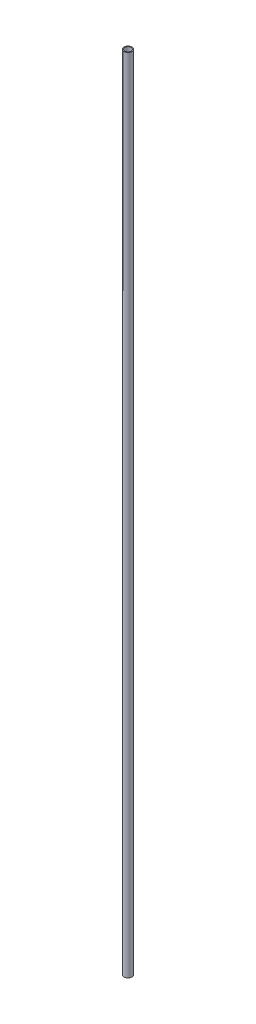
ISO-10303-21;
HEADER;
FILE_DESCRIPTION(('STEP AP214'),'2;1');
FILE_NAME('part.step','',(''),(''),'','','');
FILE_SCHEMA(('AUTOMOTIVE_DESIGN { 1 0 10303 214 1 1 1 1 }'));
ENDSEC;
DATA;
#1=APPLICATION_CONTEXT('core data for automotive mechanical design processes');
#2=APPLICATION_PROTOCOL_DEFINITION('international standard','automotive_design',2000,#1);
#3=PRODUCT_CONTEXT('',#1,'mechanical');
#4=PRODUCT('Part','Part','',(#3));
#5=PRODUCT_RELATED_PRODUCT_CATEGORY('part','',(#4));
#6=PRODUCT_DEFINITION_FORMATION('','',#4);
#7=PRODUCT_DEFINITION_CONTEXT('part definition',#1,'design');
#8=PRODUCT_DEFINITION('design','',#6,#7);
#9=PRODUCT_DEFINITION_SHAPE('','',#8);
#10=(LENGTH_UNIT() NAMED_UNIT(*) SI_UNIT(.MILLI.,.METRE.));
#11=(NAMED_UNIT(*) PLANE_ANGLE_UNIT() SI_UNIT($,.RADIAN.));
#12=(NAMED_UNIT(*) SI_UNIT($,.STERADIAN.) SOLID_ANGLE_UNIT());
#13=UNCERTAINTY_MEASURE_WITH_UNIT(LENGTH_MEASURE(1.E-05),#10,'distance_accuracy_value','');
#14=(GEOMETRIC_REPRESENTATION_CONTEXT(3) GLOBAL_UNCERTAINTY_ASSIGNED_CONTEXT((#13)) GLOBAL_UNIT_ASSIGNED_CONTEXT((#10,
#11,#12)) REPRESENTATION_CONTEXT('',''));
#15=CARTESIAN_POINT('',(0.,0.,0.));
#16=DIRECTION('',(0.,0.,1.));
#17=DIRECTION('',(1.,0.,0.));
#18=AXIS2_PLACEMENT_3D('',#15,#16,#17);
#19=CARTESIAN_POINT('',(0.,1000.,0.));
#20=DIRECTION('',(0.,1.,0.));
#21=DIRECTION('',(0.,0.,1.));
#22=AXIS2_PLACEMENT_3D('',#19,#20,#21);
#23=PLANE('',#22);
#24=CARTESIAN_POINT('',(0.,1000.,0.));
#25=DIRECTION('',(0.,1.,0.));
#26=DIRECTION('',(0.,0.,1.));
#27=AXIS2_PLACEMENT_3D('',#24,#25,#26);
#28=CIRCLE('',#27,5.);
#29=CARTESIAN_POINT('',(0.,1000.,5.));
#30=VERTEX_POINT('',#29);
#31=EDGE_CURVE('E10',#30,#30,#28,.T.);
#32=ORIENTED_EDGE('',*,*,#31,.T.);
#33=EDGE_LOOP('',(#32));
#34=FACE_BOUND('',#33,.T.);
#35=CARTESIAN_POINT('',(0.,1000.,0.));
#36=DIRECTION('',(0.,1.,0.));
#37=DIRECTION('',(0.,0.,1.));
#38=AXIS2_PLACEMENT_3D('',#35,#36,#37);
#39=CIRCLE('',#38,4.);
#40=CARTESIAN_POINT('',(0.,1000.,4.));
#41=VERTEX_POINT('',#40);
#42=EDGE_CURVE('E42',#41,#41,#39,.T.);
#43=ORIENTED_EDGE('',*,*,#42,.F.);
#44=EDGE_LOOP('',(#43));
#45=FACE_BOUND('',#44,.T.);
#46=ADVANCED_FACE('F31',(#34,#45),#23,.T.);
#47=CARTESIAN_POINT('',(0.,0.,0.));
#48=DIRECTION('',(0.,1.,0.));
#49=DIRECTION('',(0.,0.,1.));
#50=AXIS2_PLACEMENT_3D('',#47,#48,#49);
#51=PLANE('',#50);
#52=CARTESIAN_POINT('',(0.,0.,0.));
#53=DIRECTION('',(0.,1.,0.));
#54=DIRECTION('',(0.,0.,1.));
#55=AXIS2_PLACEMENT_3D('',#52,#53,#54);
#56=CIRCLE('',#55,5.);
#57=CARTESIAN_POINT('',(0.,0.,5.));
#58=VERTEX_POINT('',#57);
#59=EDGE_CURVE('E35',#58,#58,#56,.T.);
#60=ORIENTED_EDGE('',*,*,#59,.F.);
#61=EDGE_LOOP('',(#60));
#62=FACE_BOUND('',#61,.T.);
#63=CARTESIAN_POINT('',(0.,0.,0.));
#64=DIRECTION('',(0.,1.,0.));
#65=DIRECTION('',(0.,0.,1.));
#66=AXIS2_PLACEMENT_3D('',#63,#64,#65);
#67=CIRCLE('',#66,4.);
#68=CARTESIAN_POINT('',(0.,0.,4.));
#69=VERTEX_POINT('',#68);
#70=EDGE_CURVE('E44',#69,#69,#67,.T.);
#71=ORIENTED_EDGE('',*,*,#70,.T.);
#72=EDGE_LOOP('',(#71));
#73=FACE_BOUND('',#72,.T.);
#74=ADVANCED_FACE('F54',(#62,#73),#51,.F.);
#75=CARTESIAN_POINT('',(0.,1000.,0.));
#76=DIRECTION('',(0.,-1.,0.));
#77=DIRECTION('',(0.,0.,-1.));
#78=AXIS2_PLACEMENT_3D('',#75,#76,#77);
#79=CYLINDRICAL_SURFACE('',#78,5.);
#80=ORIENTED_EDGE('',*,*,#31,.F.);
#81=EDGE_LOOP('',(#80));
#82=FACE_BOUND('',#81,.T.);
#83=ORIENTED_EDGE('',*,*,#59,.T.);
#84=EDGE_LOOP('',(#83));
#85=FACE_BOUND('',#84,.T.);
#86=ADVANCED_FACE('F33',(#82,#85),#79,.T.);
#87=CARTESIAN_POINT('',(0.,1000.,0.));
#88=DIRECTION('',(0.,-1.,0.));
#89=DIRECTION('',(0.,0.,-1.));
#90=AXIS2_PLACEMENT_3D('',#87,#88,#89);
#91=CYLINDRICAL_SURFACE('',#90,4.);
#92=ORIENTED_EDGE('',*,*,#42,.T.);
#93=EDGE_LOOP('',(#92));
#94=FACE_BOUND('',#93,.T.);
#95=ORIENTED_EDGE('',*,*,#70,.F.);
#96=EDGE_LOOP('',(#95));
#97=FACE_BOUND('',#96,.T.);
#98=ADVANCED_FACE('F50',(#94,#97),#91,.F.);
#99=CLOSED_SHELL('',(#46,#74,#86,#98));
#100=MANIFOLD_SOLID_BREP('B2',#99);
#101=ADVANCED_BREP_SHAPE_REPRESENTATION('',(#18,#100),#14);
#102=SHAPE_DEFINITION_REPRESENTATION(#9,#101);
ENDSEC;
END-ISO-10303-21;
